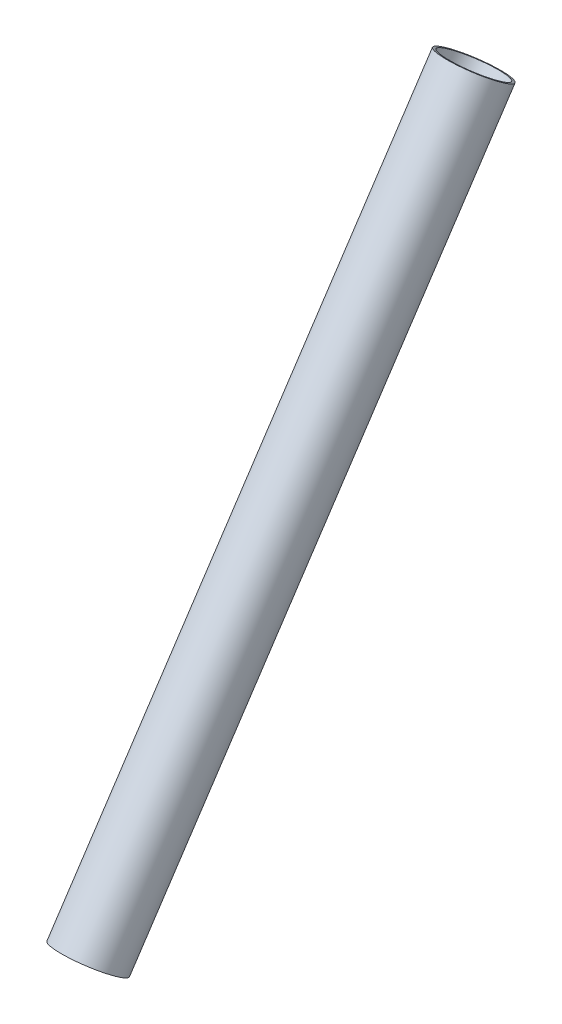
ISO-10303-21;
HEADER;
FILE_DESCRIPTION(('STEP AP214'),'2;1');
FILE_NAME('part.step','',(''),(''),'','','');
FILE_SCHEMA(('AUTOMOTIVE_DESIGN { 1 0 10303 214 1 1 1 1 }'));
ENDSEC;
DATA;
#1=APPLICATION_CONTEXT('core data for automotive mechanical design processes');
#2=APPLICATION_PROTOCOL_DEFINITION('international standard','automotive_design',2000,#1);
#3=PRODUCT_CONTEXT('',#1,'mechanical');
#4=PRODUCT('Part','Part','',(#3));
#5=PRODUCT_RELATED_PRODUCT_CATEGORY('part','',(#4));
#6=PRODUCT_DEFINITION_FORMATION('','',#4);
#7=PRODUCT_DEFINITION_CONTEXT('part definition',#1,'design');
#8=PRODUCT_DEFINITION('design','',#6,#7);
#9=PRODUCT_DEFINITION_SHAPE('','',#8);
#10=(LENGTH_UNIT() NAMED_UNIT(*) SI_UNIT(.MILLI.,.METRE.));
#11=(NAMED_UNIT(*) PLANE_ANGLE_UNIT() SI_UNIT($,.RADIAN.));
#12=(NAMED_UNIT(*) SI_UNIT($,.STERADIAN.) SOLID_ANGLE_UNIT());
#13=UNCERTAINTY_MEASURE_WITH_UNIT(LENGTH_MEASURE(1.E-05),#10,'distance_accuracy_value','');
#14=(GEOMETRIC_REPRESENTATION_CONTEXT(3) GLOBAL_UNCERTAINTY_ASSIGNED_CONTEXT((#13)) GLOBAL_UNIT_ASSIGNED_CONTEXT((#10,
#11,#12)) REPRESENTATION_CONTEXT('',''));
#15=CARTESIAN_POINT('',(0.,0.,0.));
#16=DIRECTION('',(0.,0.,1.));
#17=DIRECTION('',(1.,0.,0.));
#18=AXIS2_PLACEMENT_3D('',#15,#16,#17);
#19=CARTESIAN_POINT('',(30.6215997125882,426.066881789906,1553.75241403943));
#20=DIRECTION('',(0.00107002312813674,-0.832532279328697,0.553975503904523));
#21=DIRECTION('',(0.,-0.553975821041782,-0.832532755932812));
#22=AXIS2_PLACEMENT_3D('',#19,#20,#21);
#23=PLANE('',#22);
#24=CARTESIAN_POINT('',(30.6215997125882,426.066881789906,1553.75241403943));
#25=DIRECTION('',(0.00107002312813674,-0.832532279328697,0.553975503904523));
#26=DIRECTION('',(0.,-0.553975821041782,-0.832532755932812));
#27=AXIS2_PLACEMENT_3D('',#24,#25,#26);
#28=CIRCLE('',#27,9.60119999775789);
#29=CARTESIAN_POINT('',(30.6215997125882,420.748049138161,1545.75910054503));
#30=VERTEX_POINT('',#29);
#31=EDGE_CURVE('E10',#30,#30,#28,.T.);
#32=ORIENTED_EDGE('',*,*,#31,.T.);
#33=EDGE_LOOP('',(#32));
#34=FACE_BOUND('',#33,.T.);
#35=CARTESIAN_POINT('',(30.6215997125882,426.066881789906,1553.75241403943));
#36=DIRECTION('',(0.00107002312813674,-0.832532279328697,0.553975503904523));
#37=DIRECTION('',(0.,-0.553975821041782,-0.832532755932812));
#38=AXIS2_PLACEMENT_3D('',#35,#36,#37);
#39=CIRCLE('',#38,8.81379999775845);
#40=CARTESIAN_POINT('',(30.6215997125882,421.184249699649,1546.41463683705));
#41=VERTEX_POINT('',#40);
#42=EDGE_CURVE('E44',#41,#41,#39,.T.);
#43=ORIENTED_EDGE('',*,*,#42,.F.);
#44=EDGE_LOOP('',(#43));
#45=FACE_BOUND('',#44,.T.);
#46=ADVANCED_FACE('F33',(#34,#45),#23,.T.);
#47=CARTESIAN_POINT('',(30.3965020228543,601.204304316612,1437.21417966009));
#48=DIRECTION('',(0.00107002312813674,-0.832532279328697,0.553975503904523));
#49=DIRECTION('',(0.,-0.553975821041782,-0.832532755932812));
#50=AXIS2_PLACEMENT_3D('',#47,#48,#49);
#51=PLANE('',#50);
#52=CARTESIAN_POINT('',(30.3965020228543,601.204304316612,1437.21417966009));
#53=DIRECTION('',(0.00107002312813674,-0.832532279328697,0.553975503904523));
#54=DIRECTION('',(0.,-0.553975821041782,-0.832532755932812));
#55=AXIS2_PLACEMENT_3D('',#52,#53,#54);
#56=CIRCLE('',#55,9.60119999775789);
#57=CARTESIAN_POINT('',(30.3965020228543,595.885471664868,1429.22086616569));
#58=VERTEX_POINT('',#57);
#59=EDGE_CURVE('E37',#58,#58,#56,.T.);
#60=ORIENTED_EDGE('',*,*,#59,.F.);
#61=EDGE_LOOP('',(#60));
#62=FACE_BOUND('',#61,.T.);
#63=CARTESIAN_POINT('',(30.3965020228543,601.204304316612,1437.21417966009));
#64=DIRECTION('',(0.00107002312813674,-0.832532279328697,0.553975503904523));
#65=DIRECTION('',(0.,-0.553975821041782,-0.832532755932812));
#66=AXIS2_PLACEMENT_3D('',#63,#64,#65);
#67=CIRCLE('',#66,8.81379999775845);
#68=CARTESIAN_POINT('',(30.3965020228543,596.321672226356,1429.87640245772));
#69=VERTEX_POINT('',#68);
#70=EDGE_CURVE('E46',#69,#69,#67,.T.);
#71=ORIENTED_EDGE('',*,*,#70,.T.);
#72=EDGE_LOOP('',(#71));
#73=FACE_BOUND('',#72,.T.);
#74=ADVANCED_FACE('F56',(#62,#73),#51,.F.);
#75=CARTESIAN_POINT('',(30.6215997125882,426.066881789906,1553.75241403943));
#76=DIRECTION('',(-0.00107002312813674,0.832532279328697,-0.553975503904523));
#77=DIRECTION('',(0.,0.553975821041782,0.832532755932812));
#78=AXIS2_PLACEMENT_3D('',#75,#76,#77);
#79=CYLINDRICAL_SURFACE('',#78,9.60119999775789);
#80=ORIENTED_EDGE('',*,*,#31,.F.);
#81=EDGE_LOOP('',(#80));
#82=FACE_BOUND('',#81,.T.);
#83=ORIENTED_EDGE('',*,*,#59,.T.);
#84=EDGE_LOOP('',(#83));
#85=FACE_BOUND('',#84,.T.);
#86=ADVANCED_FACE('F35',(#82,#85),#79,.T.);
#87=CARTESIAN_POINT('',(30.6215997125882,426.066881789906,1553.75241403943));
#88=DIRECTION('',(-0.00107002312813674,0.832532279328697,-0.553975503904523));
#89=DIRECTION('',(0.,0.553975821041782,0.832532755932812));
#90=AXIS2_PLACEMENT_3D('',#87,#88,#89);
#91=CYLINDRICAL_SURFACE('',#90,8.81379999775845);
#92=ORIENTED_EDGE('',*,*,#42,.T.);
#93=EDGE_LOOP('',(#92));
#94=FACE_BOUND('',#93,.T.);
#95=ORIENTED_EDGE('',*,*,#70,.F.);
#96=EDGE_LOOP('',(#95));
#97=FACE_BOUND('',#96,.T.);
#98=ADVANCED_FACE('F52',(#94,#97),#91,.F.);
#99=CLOSED_SHELL('',(#46,#74,#86,#98));
#100=MANIFOLD_SOLID_BREP('B2',#99);
#101=ADVANCED_BREP_SHAPE_REPRESENTATION('',(#18,#100),#14);
#102=SHAPE_DEFINITION_REPRESENTATION(#9,#101);
ENDSEC;
END-ISO-10303-21;
